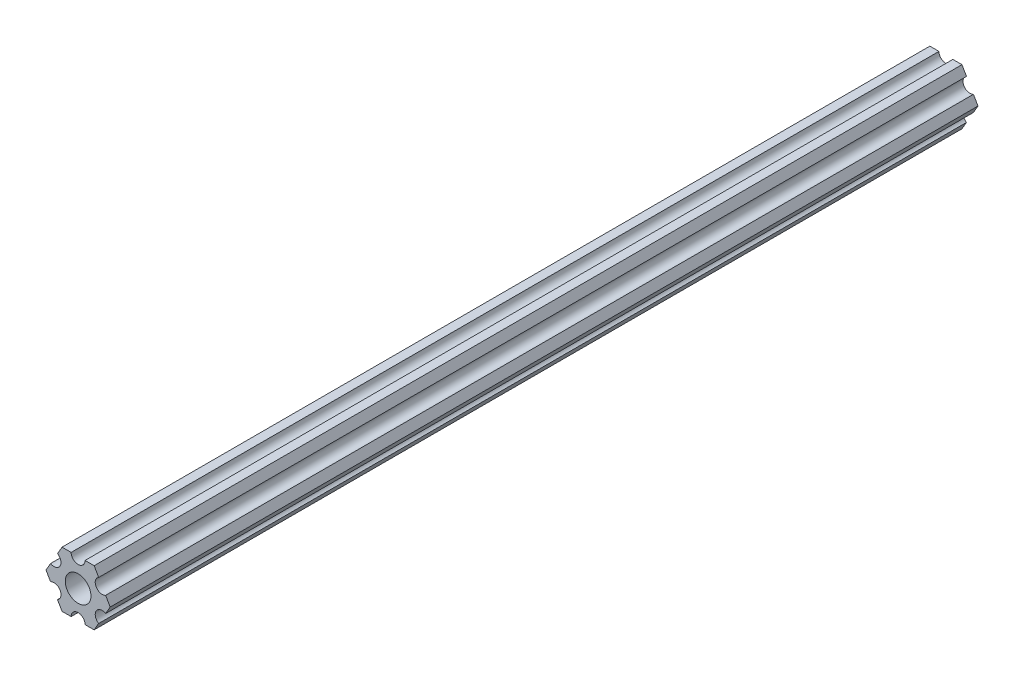
ISO-10303-21;
HEADER;
FILE_DESCRIPTION(('STEP AP214'),'2;1');
FILE_NAME('part.step','',(''),(''),'','','');
FILE_SCHEMA(('AUTOMOTIVE_DESIGN { 1 0 10303 214 1 1 1 1 }'));
ENDSEC;
DATA;
#1=APPLICATION_CONTEXT('core data for automotive mechanical design processes');
#2=APPLICATION_PROTOCOL_DEFINITION('international standard','automotive_design',2000,#1);
#3=PRODUCT_CONTEXT('',#1,'mechanical');
#4=PRODUCT('Part','Part','',(#3));
#5=PRODUCT_RELATED_PRODUCT_CATEGORY('part','',(#4));
#6=PRODUCT_DEFINITION_FORMATION('','',#4);
#7=PRODUCT_DEFINITION_CONTEXT('part definition',#1,'design');
#8=PRODUCT_DEFINITION('design','',#6,#7);
#9=PRODUCT_DEFINITION_SHAPE('','',#8);
#10=(LENGTH_UNIT() NAMED_UNIT(*) SI_UNIT(.MILLI.,.METRE.));
#11=(NAMED_UNIT(*) PLANE_ANGLE_UNIT() SI_UNIT($,.RADIAN.));
#12=(NAMED_UNIT(*) SI_UNIT($,.STERADIAN.) SOLID_ANGLE_UNIT());
#13=UNCERTAINTY_MEASURE_WITH_UNIT(LENGTH_MEASURE(1.E-05),#10,'distance_accuracy_value','');
#14=(GEOMETRIC_REPRESENTATION_CONTEXT(3) GLOBAL_UNCERTAINTY_ASSIGNED_CONTEXT((#13)) GLOBAL_UNIT_ASSIGNED_CONTEXT((#10,
#11,#12)) REPRESENTATION_CONTEXT('',''));
#15=CARTESIAN_POINT('',(0.,0.,0.));
#16=DIRECTION('',(0.,0.,1.));
#17=DIRECTION('',(1.,0.,0.));
#18=AXIS2_PLACEMENT_3D('',#15,#16,#17);
#19=CARTESIAN_POINT('',(6.29301142309098,-1.80018429024546,304.8));
#20=DIRECTION('',(-0.866025434075723,0.499999947533953,0.));
#21=DIRECTION('',(-0.499999947533953,-0.866025434075723,0.));
#22=AXIS2_PLACEMENT_3D('',#19,#20,#21);
#23=PLANE('',#22);
#24=DIRECTION('',(0.499999947533953,0.866025434075723,0.));
#25=VECTOR('',#24,1.);
#26=CARTESIAN_POINT('',(6.29301142309098,-1.80018429024546,-130.524));
#27=LINE('',#26,#25);
#28=CARTESIAN_POINT('',(6.29301142309098,-1.80018429024546,-130.524));
#29=VERTEX_POINT('',#28);
#30=CARTESIAN_POINT('',(7.33234841870826,4.44212518896171E-07,-130.524));
#31=VERTEX_POINT('',#30);
#32=EDGE_CURVE('E140',#29,#31,#27,.T.);
#33=ORIENTED_EDGE('',*,*,#32,.T.);
#34=DIRECTION('',(0.,0.,1.));
#35=VECTOR('',#34,1.);
#36=CARTESIAN_POINT('',(7.33234841870826,4.44212519225153E-07,304.8));
#37=LINE('',#36,#35);
#38=CARTESIAN_POINT('',(7.33234841870826,4.44212519207655E-07,67.726));
#39=VERTEX_POINT('',#38);
#40=EDGE_CURVE('E127',#31,#39,#37,.T.);
#41=ORIENTED_EDGE('',*,*,#40,.T.);
#42=DIRECTION('',(0.499999947533953,0.866025434075723,0.));
#43=VECTOR('',#42,1.);
#44=CARTESIAN_POINT('',(6.29301142309098,-1.80018429024546,67.726));
#45=LINE('',#44,#43);
#46=CARTESIAN_POINT('',(6.29301142309098,-1.80018429024546,67.726));
#47=VERTEX_POINT('',#46);
#48=EDGE_CURVE('E146',#47,#39,#45,.T.);
#49=ORIENTED_EDGE('',*,*,#48,.F.);
#50=DIRECTION('',(0.,0.,-1.));
#51=VECTOR('',#50,1.);
#52=CARTESIAN_POINT('',(6.29301142309098,-1.80018429024546,304.8));
#53=LINE('',#52,#51);
#54=EDGE_CURVE('E145',#47,#29,#53,.T.);
#55=ORIENTED_EDGE('',*,*,#54,.T.);
#56=EDGE_LOOP('',(#33,#41,#49,#55));
#57=FACE_BOUND('',#56,.T.);
#58=ADVANCED_FACE('F16',(#57),#23,.F.);
#59=CARTESIAN_POINT('',(7.33234841870826,4.44212519169686E-07,304.8));
#60=DIRECTION('',(-0.866025373493145,-0.500000052466056,0.));
#61=DIRECTION('',(0.500000052466056,-0.866025373493145,0.));
#62=AXIS2_PLACEMENT_3D('',#59,#60,#61);
#63=PLANE('',#62);
#64=DIRECTION('',(-0.500000052466056,0.866025373493145,0.));
#65=VECTOR('',#64,1.);
#66=CARTESIAN_POINT('',(7.33234841870826,4.44212519198905E-07,-130.524));
#67=LINE('',#66,#65);
#68=CARTESIAN_POINT('',(6.29301120497139,1.80018505273894,-130.524));
#69=VERTEX_POINT('',#68);
#70=EDGE_CURVE('E130',#31,#69,#67,.T.);
#71=ORIENTED_EDGE('',*,*,#70,.T.);
#72=DIRECTION('',(0.,0.,-1.));
#73=VECTOR('',#72,1.);
#74=CARTESIAN_POINT('',(6.29301120497139,1.80018505273894,304.8));
#75=LINE('',#74,#73);
#76=CARTESIAN_POINT('',(6.29301120497139,1.80018505273894,67.726));
#77=VERTEX_POINT('',#76);
#78=EDGE_CURVE('E119',#69,#77,#75,.F.);
#79=ORIENTED_EDGE('',*,*,#78,.T.);
#80=DIRECTION('',(-0.500000052466056,0.866025373493145,0.));
#81=VECTOR('',#80,1.);
#82=CARTESIAN_POINT('',(7.33234841870826,4.44212519198905E-07,67.726));
#83=LINE('',#82,#81);
#84=EDGE_CURVE('E131',#39,#77,#83,.T.);
#85=ORIENTED_EDGE('',*,*,#84,.F.);
#86=ORIENTED_EDGE('',*,*,#40,.F.);
#87=EDGE_LOOP('',(#71,#79,#85,#86));
#88=FACE_BOUND('',#87,.T.);
#89=ADVANCED_FACE('F129',(#88),#63,.F.);
#90=CARTESIAN_POINT('',(5.49926112168156,3.17500033315933,304.8));
#91=DIRECTION('',(0.,0.,-1.));
#92=DIRECTION('',(-1.,0.,0.));
#93=AXIS2_PLACEMENT_3D('',#90,#91,#92);
#94=CYLINDRICAL_SURFACE('',#93,1.5875);
#95=CARTESIAN_POINT('',(5.49926112168156,3.17500033315933,-130.524));
#96=DIRECTION('',(0.,0.,-1.));
#97=DIRECTION('',(-1.,0.,0.));
#98=AXIS2_PLACEMENT_3D('',#95,#96,#97);
#99=CIRCLE('',#98,1.5875);
#100=CARTESIAN_POINT('',(4.70551103839172,4.54981561357972,-130.524));
#101=VERTEX_POINT('',#100);
#102=EDGE_CURVE('E19',#69,#101,#99,.T.);
#103=ORIENTED_EDGE('',*,*,#102,.T.);
#104=DIRECTION('',(0.,0.,1.));
#105=VECTOR('',#104,1.);
#106=CARTESIAN_POINT('',(4.70551103839172,4.54981561357972,304.8));
#107=LINE('',#106,#105);
#108=CARTESIAN_POINT('',(4.70551103839172,4.54981561357972,67.726));
#109=VERTEX_POINT('',#108);
#110=EDGE_CURVE('E262',#101,#109,#107,.T.);
#111=ORIENTED_EDGE('',*,*,#110,.T.);
#112=CARTESIAN_POINT('',(5.49926112168156,3.17500033315933,67.726));
#113=DIRECTION('',(0.,0.,-1.));
#114=DIRECTION('',(-1.,0.,0.));
#115=AXIS2_PLACEMENT_3D('',#112,#113,#114);
#116=CIRCLE('',#115,1.5875);
#117=EDGE_CURVE('E290',#77,#109,#116,.T.);
#118=ORIENTED_EDGE('',*,*,#117,.F.);
#119=ORIENTED_EDGE('',*,*,#78,.F.);
#120=EDGE_LOOP('',(#103,#111,#118,#119));
#121=FACE_BOUND('',#120,.T.);
#122=ADVANCED_FACE('F560',(#121),#94,.F.);
#123=CARTESIAN_POINT('',(4.70551103839172,4.54981561357972,304.8));
#124=DIRECTION('',(-0.866025373493151,-0.500000052466046,0.));
#125=DIRECTION('',(0.500000052466046,-0.866025373493151,0.));
#126=AXIS2_PLACEMENT_3D('',#123,#124,#125);
#127=PLANE('',#126);
#128=DIRECTION('',(-0.500000052466044,0.866025373493152,0.));
#129=VECTOR('',#128,1.);
#130=CARTESIAN_POINT('',(4.70551103839172,4.54981561357972,-130.524));
#131=LINE('',#130,#129);
#132=CARTESIAN_POINT('',(3.66617382465481,6.35000022210627,-130.524));
#133=VERTEX_POINT('',#132);
#134=EDGE_CURVE('E204',#101,#133,#131,.T.);
#135=ORIENTED_EDGE('',*,*,#134,.T.);
#136=DIRECTION('',(0.,0.,1.));
#137=VECTOR('',#136,1.);
#138=CARTESIAN_POINT('',(3.66617382465481,6.35000022210627,304.8));
#139=LINE('',#138,#137);
#140=CARTESIAN_POINT('',(3.66617382465481,6.35000022210627,67.726));
#141=VERTEX_POINT('',#140);
#142=EDGE_CURVE('E259',#133,#141,#139,.T.);
#143=ORIENTED_EDGE('',*,*,#142,.T.);
#144=DIRECTION('',(-0.500000052466044,0.866025373493152,0.));
#145=VECTOR('',#144,1.);
#146=CARTESIAN_POINT('',(4.70551103839172,4.54981561357972,67.726));
#147=LINE('',#146,#145);
#148=EDGE_CURVE('E291',#109,#141,#147,.T.);
#149=ORIENTED_EDGE('',*,*,#148,.F.);
#150=ORIENTED_EDGE('',*,*,#110,.F.);
#151=EDGE_LOOP('',(#135,#143,#149,#150));
#152=FACE_BOUND('',#151,.T.);
#153=ADVANCED_FACE('F314',(#152),#127,.F.);
#154=CARTESIAN_POINT('',(3.66617382465481,6.35000022210627,304.8));
#155=DIRECTION('',(6.05825850611185E-08,-0.999999999999998,0.));
#156=DIRECTION('',(0.999999999999998,6.05825850611185E-08,0.));
#157=AXIS2_PLACEMENT_3D('',#154,#155,#156);
#158=PLANE('',#157);
#159=DIRECTION('',(1.,0.,0.));
#160=VECTOR('',#159,1.);
#161=CARTESIAN_POINT('',(5.49926112168156,6.35000022210627,-130.524));
#162=LINE('',#161,#160);
#163=CARTESIAN_POINT('',(1.58749961530073,6.35000015914054,-130.524));
#164=VERTEX_POINT('',#163);
#165=EDGE_CURVE('E201',#133,#164,#162,.F.);
#166=ORIENTED_EDGE('',*,*,#165,.T.);
#167=DIRECTION('',(0.,0.,-1.));
#168=VECTOR('',#167,1.);
#169=CARTESIAN_POINT('',(1.58749961530074,6.35000009617482,304.8));
#170=LINE('',#169,#168);
#171=CARTESIAN_POINT('',(1.58749961530073,6.35000015914054,67.726));
#172=VERTEX_POINT('',#171);
#173=EDGE_CURVE('E256',#164,#172,#170,.F.);
#174=ORIENTED_EDGE('',*,*,#173,.T.);
#175=DIRECTION('',(1.,0.,0.));
#176=VECTOR('',#175,1.);
#177=CARTESIAN_POINT('',(5.49926112168156,6.35000022210627,67.726));
#178=LINE('',#177,#176);
#179=EDGE_CURVE('E289',#141,#172,#178,.F.);
#180=ORIENTED_EDGE('',*,*,#179,.F.);
#181=ORIENTED_EDGE('',*,*,#142,.F.);
#182=EDGE_LOOP('',(#166,#174,#180,#181));
#183=FACE_BOUND('',#182,.T.);
#184=ADVANCED_FACE('F309',(#183),#158,.F.);
#185=CARTESIAN_POINT('',(-3.84699260060323E-07,6.35,304.8));
#186=DIRECTION('',(0.,0.,-1.));
#187=DIRECTION('',(-1.,0.,0.));
#188=AXIS2_PLACEMENT_3D('',#185,#186,#187);
#189=CYLINDRICAL_SURFACE('',#188,1.5875);
#190=CARTESIAN_POINT('',(-3.84699260060323E-07,6.35,-130.524));
#191=DIRECTION('',(0.,0.,-1.));
#192=DIRECTION('',(-1.,0.,0.));
#193=AXIS2_PLACEMENT_3D('',#190,#191,#192);
#194=CIRCLE('',#193,1.5875);
#195=CARTESIAN_POINT('',(-1.58750038469926,6.34999990382518,-130.524));
#196=VERTEX_POINT('',#195);
#197=EDGE_CURVE('E198',#164,#196,#194,.T.);
#198=ORIENTED_EDGE('',*,*,#197,.T.);
#199=DIRECTION('',(0.,0.,1.));
#200=VECTOR('',#199,1.);
#201=CARTESIAN_POINT('',(-1.58750038469926,6.34999990382518,304.8));
#202=LINE('',#201,#200);
#203=CARTESIAN_POINT('',(-1.58750038469926,6.34999990382518,67.726));
#204=VERTEX_POINT('',#203);
#205=EDGE_CURVE('E251',#196,#204,#202,.T.);
#206=ORIENTED_EDGE('',*,*,#205,.T.);
#207=CARTESIAN_POINT('',(-3.84699260060323E-07,6.35,67.726));
#208=DIRECTION('',(0.,0.,-1.));
#209=DIRECTION('',(-1.,0.,0.));
#210=AXIS2_PLACEMENT_3D('',#207,#208,#209);
#211=CIRCLE('',#210,1.5875);
#212=EDGE_CURVE('E286',#172,#204,#211,.T.);
#213=ORIENTED_EDGE('',*,*,#212,.F.);
#214=ORIENTED_EDGE('',*,*,#173,.F.);
#215=EDGE_LOOP('',(#198,#206,#213,#214));
#216=FACE_BOUND('',#215,.T.);
#217=ADVANCED_FACE('F301',(#216),#189,.F.);
#218=CARTESIAN_POINT('',(-1.58750038469926,6.34999990382518,304.8));
#219=DIRECTION('',(6.05825963273174E-08,-0.999999999999998,0.));
#220=DIRECTION('',(0.999999999999998,6.05825963273174E-08,0.));
#221=AXIS2_PLACEMENT_3D('',#218,#219,#220);
#222=PLANE('',#221);
#223=DIRECTION('',(1.,0.,0.));
#224=VECTOR('',#223,1.);
#225=CARTESIAN_POINT('',(5.49926112168156,6.34999990382519,-130.524));
#226=LINE('',#225,#224);
#227=CARTESIAN_POINT('',(-3.66617454558244,6.34999986184803,-130.524));
#228=VERTEX_POINT('',#227);
#229=EDGE_CURVE('E193',#196,#228,#226,.F.);
#230=ORIENTED_EDGE('',*,*,#229,.T.);
#231=DIRECTION('',(0.,0.,1.));
#232=VECTOR('',#231,1.);
#233=CARTESIAN_POINT('',(-3.66617459405349,6.3499997778937,304.8));
#234=LINE('',#233,#232);
#235=CARTESIAN_POINT('',(-3.66617454558244,6.34999986184803,67.726));
#236=VERTEX_POINT('',#235);
#237=EDGE_CURVE('E248',#228,#236,#234,.T.);
#238=ORIENTED_EDGE('',*,*,#237,.T.);
#239=DIRECTION('',(1.,0.,0.));
#240=VECTOR('',#239,1.);
#241=CARTESIAN_POINT('',(5.49926112168156,6.34999990382519,67.726));
#242=LINE('',#241,#240);
#243=EDGE_CURVE('E288',#204,#236,#242,.F.);
#244=ORIENTED_EDGE('',*,*,#243,.F.);
#245=ORIENTED_EDGE('',*,*,#205,.F.);
#246=EDGE_LOOP('',(#230,#238,#244,#245));
#247=FACE_BOUND('',#246,.T.);
#248=ADVANCED_FACE('F369',(#247),#222,.F.);
#249=CARTESIAN_POINT('',(-3.66617459405349,6.3499997778937,304.8));
#250=DIRECTION('',(0.866025434075729,-0.499999947533943,0.));
#251=DIRECTION('',(0.499999947533943,0.866025434075729,0.));
#252=AXIS2_PLACEMENT_3D('',#249,#250,#251);
#253=PLANE('',#252);
#254=DIRECTION('',(-0.499999947533941,-0.86602543407573,0.));
#255=VECTOR('',#254,1.);
#256=CARTESIAN_POINT('',(-3.66617459405349,6.3499997778937,-130.524));
#257=LINE('',#256,#255);
#258=CARTESIAN_POINT('',(-4.70551158967065,4.54981504343587,-130.524));
#259=VERTEX_POINT('',#258);
#260=EDGE_CURVE('E190',#228,#259,#257,.T.);
#261=ORIENTED_EDGE('',*,*,#260,.T.);
#262=DIRECTION('',(0.,0.,-1.));
#263=VECTOR('',#262,1.);
#264=CARTESIAN_POINT('',(-4.70551158967065,4.54981504343587,304.8));
#265=LINE('',#264,#263);
#266=CARTESIAN_POINT('',(-4.70551158967065,4.54981504343587,67.726));
#267=VERTEX_POINT('',#266);
#268=EDGE_CURVE('E245',#259,#267,#265,.F.);
#269=ORIENTED_EDGE('',*,*,#268,.T.);
#270=DIRECTION('',(-0.499999947533941,-0.86602543407573,0.));
#271=VECTOR('',#270,1.);
#272=CARTESIAN_POINT('',(-3.66617459405349,6.3499997778937,67.726));
#273=LINE('',#272,#271);
#274=EDGE_CURVE('E285',#236,#267,#273,.T.);
#275=ORIENTED_EDGE('',*,*,#274,.F.);
#276=ORIENTED_EDGE('',*,*,#237,.F.);
#277=EDGE_LOOP('',(#261,#269,#275,#276));
#278=FACE_BOUND('',#277,.T.);
#279=ADVANCED_FACE('F371',(#278),#253,.F.);
#280=CARTESIAN_POINT('',(-5.49926150638082,3.17499966684067,304.8));
#281=DIRECTION('',(0.,0.,-1.));
#282=DIRECTION('',(-1.,0.,0.));
#283=AXIS2_PLACEMENT_3D('',#280,#281,#282);
#284=CYLINDRICAL_SURFACE('',#283,1.5875);
#285=CARTESIAN_POINT('',(-5.49926150638082,3.17499966684067,-130.524));
#286=DIRECTION('',(0.,0.,-1.));
#287=DIRECTION('',(-1.,0.,0.));
#288=AXIS2_PLACEMENT_3D('',#285,#286,#287);
#289=CIRCLE('',#288,1.5875);
#290=CARTESIAN_POINT('',(-6.29301142309098,1.80018429024547,-130.524));
#291=VERTEX_POINT('',#290);
#292=EDGE_CURVE('E187',#259,#291,#289,.T.);
#293=ORIENTED_EDGE('',*,*,#292,.T.);
#294=DIRECTION('',(0.,0.,1.));
#295=VECTOR('',#294,1.);
#296=CARTESIAN_POINT('',(-6.29301142309098,1.80018429024547,304.8));
#297=LINE('',#296,#295);
#298=CARTESIAN_POINT('',(-6.29301142309098,1.80018429024547,67.726));
#299=VERTEX_POINT('',#298);
#300=EDGE_CURVE('E240',#291,#299,#297,.T.);
#301=ORIENTED_EDGE('',*,*,#300,.T.);
#302=CARTESIAN_POINT('',(-5.49926150638082,3.17499966684067,67.726));
#303=DIRECTION('',(0.,0.,-1.));
#304=DIRECTION('',(-1.,0.,0.));
#305=AXIS2_PLACEMENT_3D('',#302,#303,#304);
#306=CIRCLE('',#305,1.5875);
#307=EDGE_CURVE('E282',#267,#299,#306,.T.);
#308=ORIENTED_EDGE('',*,*,#307,.F.);
#309=ORIENTED_EDGE('',*,*,#268,.F.);
#310=EDGE_LOOP('',(#293,#301,#308,#309));
#311=FACE_BOUND('',#310,.T.);
#312=ADVANCED_FACE('F407',(#311),#284,.F.);
#313=CARTESIAN_POINT('',(-6.29301142309098,1.80018429024547,304.8));
#314=DIRECTION('',(0.866025434075724,-0.499999947533951,0.));
#315=DIRECTION('',(0.499999947533951,0.866025434075724,0.));
#316=AXIS2_PLACEMENT_3D('',#313,#314,#315);
#317=PLANE('',#316);
#318=DIRECTION('',(-0.49999994753395,-0.866025434075724,0.));
#319=VECTOR('',#318,1.);
#320=CARTESIAN_POINT('',(-6.29301142309098,1.80018429024547,-130.524));
#321=LINE('',#320,#319);
#322=CARTESIAN_POINT('',(-7.33234841870826,-4.44212523605446E-07,-130.524));
#323=VERTEX_POINT('',#322);
#324=EDGE_CURVE('E182',#291,#323,#321,.T.);
#325=ORIENTED_EDGE('',*,*,#324,.T.);
#326=DIRECTION('',(0.,0.,1.));
#327=VECTOR('',#326,1.);
#328=CARTESIAN_POINT('',(-7.33234841870826,-4.44212523744911E-07,304.8));
#329=LINE('',#328,#327);
#330=CARTESIAN_POINT('',(-7.33234841870826,-4.44212523605446E-07,67.726));
#331=VERTEX_POINT('',#330);
#332=EDGE_CURVE('E237',#323,#331,#329,.T.);
#333=ORIENTED_EDGE('',*,*,#332,.T.);
#334=DIRECTION('',(-0.49999994753395,-0.866025434075724,0.));
#335=VECTOR('',#334,1.);
#336=CARTESIAN_POINT('',(-6.29301142309098,1.80018429024547,67.726));
#337=LINE('',#336,#335);
#338=EDGE_CURVE('E284',#299,#331,#337,.T.);
#339=ORIENTED_EDGE('',*,*,#338,.F.);
#340=ORIENTED_EDGE('',*,*,#300,.F.);
#341=EDGE_LOOP('',(#325,#333,#339,#340));
#342=FACE_BOUND('',#341,.T.);
#343=ADVANCED_FACE('F360',(#342),#317,.F.);
#344=CARTESIAN_POINT('',(-7.33234841870826,-4.44212523790841E-07,304.8));
#345=DIRECTION('',(0.866025373493151,0.500000052466045,0.));
#346=DIRECTION('',(-0.500000052466045,0.866025373493151,0.));
#347=AXIS2_PLACEMENT_3D('',#344,#345,#346);
#348=PLANE('',#347);
#349=DIRECTION('',(0.500000052466043,-0.866025373493152,0.));
#350=VECTOR('',#349,1.);
#351=CARTESIAN_POINT('',(-7.33234841870826,-4.44212523535714E-07,-130.524));
#352=LINE('',#351,#350);
#353=CARTESIAN_POINT('',(-6.29301120497141,-1.80018505273897,-130.524));
#354=VERTEX_POINT('',#353);
#355=EDGE_CURVE('E179',#323,#354,#352,.T.);
#356=ORIENTED_EDGE('',*,*,#355,.T.);
#357=DIRECTION('',(0.,0.,-1.));
#358=VECTOR('',#357,1.);
#359=CARTESIAN_POINT('',(-6.29301120497141,-1.80018505273897,304.8));
#360=LINE('',#359,#358);
#361=CARTESIAN_POINT('',(-6.29301120497141,-1.80018505273897,67.726));
#362=VERTEX_POINT('',#361);
#363=EDGE_CURVE('E234',#354,#362,#360,.F.);
#364=ORIENTED_EDGE('',*,*,#363,.T.);
#365=DIRECTION('',(0.500000052466043,-0.866025373493152,0.));
#366=VECTOR('',#365,1.);
#367=CARTESIAN_POINT('',(-7.33234841870826,-4.44212523535714E-07,67.726));
#368=LINE('',#367,#366);
#369=EDGE_CURVE('E281',#331,#362,#368,.T.);
#370=ORIENTED_EDGE('',*,*,#369,.F.);
#371=ORIENTED_EDGE('',*,*,#332,.F.);
#372=EDGE_LOOP('',(#356,#364,#370,#371));
#373=FACE_BOUND('',#372,.T.);
#374=ADVANCED_FACE('F355',(#373),#348,.F.);
#375=CARTESIAN_POINT('',(-5.49926112168156,-3.17500033315934,304.8));
#376=DIRECTION('',(0.,0.,-1.));
#377=DIRECTION('',(-1.,0.,0.));
#378=AXIS2_PLACEMENT_3D('',#375,#376,#377);
#379=CYLINDRICAL_SURFACE('',#378,1.5875);
#380=CARTESIAN_POINT('',(-5.49926112168156,-3.17500033315934,-130.524));
#381=DIRECTION('',(0.,0.,-1.));
#382=DIRECTION('',(-1.,0.,0.));
#383=AXIS2_PLACEMENT_3D('',#380,#381,#382);
#384=CIRCLE('',#383,1.5875);
#385=CARTESIAN_POINT('',(-4.70551103839172,-4.54981561357972,-130.524));
#386=VERTEX_POINT('',#385);
#387=EDGE_CURVE('E176',#354,#386,#384,.T.);
#388=ORIENTED_EDGE('',*,*,#387,.T.);
#389=DIRECTION('',(0.,0.,1.));
#390=VECTOR('',#389,1.);
#391=CARTESIAN_POINT('',(-4.70551103839172,-4.54981561357972,304.8));
#392=LINE('',#391,#390);
#393=CARTESIAN_POINT('',(-4.70551103839172,-4.54981561357972,67.726));
#394=VERTEX_POINT('',#393);
#395=EDGE_CURVE('E229',#386,#394,#392,.T.);
#396=ORIENTED_EDGE('',*,*,#395,.T.);
#397=CARTESIAN_POINT('',(-5.49926112168156,-3.17500033315934,67.726));
#398=DIRECTION('',(0.,0.,-1.));
#399=DIRECTION('',(-1.,0.,0.));
#400=AXIS2_PLACEMENT_3D('',#397,#398,#399);
#401=CIRCLE('',#400,1.5875);
#402=EDGE_CURVE('E278',#362,#394,#401,.T.);
#403=ORIENTED_EDGE('',*,*,#402,.F.);
#404=ORIENTED_EDGE('',*,*,#363,.F.);
#405=EDGE_LOOP('',(#388,#396,#403,#404));
#406=FACE_BOUND('',#405,.T.);
#407=ADVANCED_FACE('F350',(#406),#379,.F.);
#408=CARTESIAN_POINT('',(-4.70551103839172,-4.54981561357972,304.8));
#409=DIRECTION('',(0.866025373493151,0.500000052466045,0.));
#410=DIRECTION('',(-0.500000052466045,0.866025373493151,0.));
#411=AXIS2_PLACEMENT_3D('',#408,#409,#410);
#412=PLANE('',#411);
#413=DIRECTION('',(0.500000052466043,-0.866025373493152,0.));
#414=VECTOR('',#413,1.);
#415=CARTESIAN_POINT('',(-4.70551103839172,-4.54981561357972,-130.524));
#416=LINE('',#415,#414);
#417=CARTESIAN_POINT('',(-3.66617382465481,-6.35000022210627,-130.524));
#418=VERTEX_POINT('',#417);
#419=EDGE_CURVE('E171',#386,#418,#416,.T.);
#420=ORIENTED_EDGE('',*,*,#419,.T.);
#421=DIRECTION('',(0.,0.,1.));
#422=VECTOR('',#421,1.);
#423=CARTESIAN_POINT('',(-3.66617382465481,-6.35000022210627,304.8));
#424=LINE('',#423,#422);
#425=CARTESIAN_POINT('',(-3.66617382465481,-6.35000022210627,67.726));
#426=VERTEX_POINT('',#425);
#427=EDGE_CURVE('E226',#418,#426,#424,.T.);
#428=ORIENTED_EDGE('',*,*,#427,.T.);
#429=DIRECTION('',(0.500000052466043,-0.866025373493152,0.));
#430=VECTOR('',#429,1.);
#431=CARTESIAN_POINT('',(-4.70551103839172,-4.54981561357972,67.726));
#432=LINE('',#431,#430);
#433=EDGE_CURVE('E280',#394,#426,#432,.T.);
#434=ORIENTED_EDGE('',*,*,#433,.F.);
#435=ORIENTED_EDGE('',*,*,#395,.F.);
#436=EDGE_LOOP('',(#420,#428,#434,#435));
#437=FACE_BOUND('',#436,.T.);
#438=ADVANCED_FACE('F345',(#437),#412,.F.);
#439=CARTESIAN_POINT('',(-3.66617382465481,-6.35000022210627,304.8));
#440=DIRECTION('',(-6.05825854783851E-08,0.999999999999998,0.));
#441=DIRECTION('',(-0.999999999999998,-6.05825854783851E-08,0.));
#442=AXIS2_PLACEMENT_3D('',#439,#440,#441);
#443=PLANE('',#442);
#444=DIRECTION('',(1.,0.,0.));
#445=VECTOR('',#444,1.);
#446=CARTESIAN_POINT('',(5.49926112168156,-6.35000022210627,-130.524));
#447=LINE('',#446,#445);
#448=CARTESIAN_POINT('',(-1.58749961530073,-6.35000011105313,-130.524));
#449=VERTEX_POINT('',#448);
#450=EDGE_CURVE('E168',#418,#449,#447,.T.);
#451=ORIENTED_EDGE('',*,*,#450,.T.);
#452=DIRECTION('',(0.,0.,-1.));
#453=VECTOR('',#452,1.);
#454=CARTESIAN_POINT('',(-1.58749961530074,-6.35,304.8));
#455=LINE('',#454,#453);
#456=CARTESIAN_POINT('',(-1.58749961530073,-6.35000011105313,67.726));
#457=VERTEX_POINT('',#456);
#458=EDGE_CURVE('E223',#449,#457,#455,.F.);
#459=ORIENTED_EDGE('',*,*,#458,.T.);
#460=DIRECTION('',(1.,0.,0.));
#461=VECTOR('',#460,1.);
#462=CARTESIAN_POINT('',(5.49926112168156,-6.35000022210627,67.726));
#463=LINE('',#462,#461);
#464=EDGE_CURVE('E277',#426,#457,#463,.T.);
#465=ORIENTED_EDGE('',*,*,#464,.F.);
#466=ORIENTED_EDGE('',*,*,#427,.F.);
#467=EDGE_LOOP('',(#451,#459,#465,#466));
#468=FACE_BOUND('',#467,.T.);
#469=ADVANCED_FACE('F339',(#468),#443,.F.);
#470=CARTESIAN_POINT('',(3.8469926204343E-07,-6.35,304.8));
#471=DIRECTION('',(0.,0.,-1.));
#472=DIRECTION('',(-1.,0.,0.));
#473=AXIS2_PLACEMENT_3D('',#470,#471,#472);
#474=CYLINDRICAL_SURFACE('',#473,1.5875);
#475=CARTESIAN_POINT('',(3.8469926204343E-07,-6.35,-130.524));
#476=DIRECTION('',(0.,0.,-1.));
#477=DIRECTION('',(-1.,0.,0.));
#478=AXIS2_PLACEMENT_3D('',#475,#476,#477);
#479=CIRCLE('',#478,1.5875);
#480=CARTESIAN_POINT('',(1.58750038469926,-6.34999990382518,-130.524));
#481=VERTEX_POINT('',#480);
#482=EDGE_CURVE('E165',#449,#481,#479,.T.);
#483=ORIENTED_EDGE('',*,*,#482,.T.);
#484=DIRECTION('',(0.,0.,1.));
#485=VECTOR('',#484,1.);
#486=CARTESIAN_POINT('',(1.58750038469926,-6.34999990382518,304.8));
#487=LINE('',#486,#485);
#488=CARTESIAN_POINT('',(1.58750038469926,-6.34999990382518,67.726));
#489=VERTEX_POINT('',#488);
#490=EDGE_CURVE('E218',#481,#489,#487,.T.);
#491=ORIENTED_EDGE('',*,*,#490,.T.);
#492=CARTESIAN_POINT('',(3.8469926204343E-07,-6.35,67.726));
#493=DIRECTION('',(0.,0.,-1.));
#494=DIRECTION('',(-1.,0.,0.));
#495=AXIS2_PLACEMENT_3D('',#492,#493,#494);
#496=CIRCLE('',#495,1.5875);
#497=EDGE_CURVE('E274',#457,#489,#496,.T.);
#498=ORIENTED_EDGE('',*,*,#497,.F.);
#499=ORIENTED_EDGE('',*,*,#458,.F.);
#500=EDGE_LOOP('',(#483,#491,#498,#499));
#501=FACE_BOUND('',#500,.T.);
#502=ADVANCED_FACE('F335',(#501),#474,.F.);
#503=CARTESIAN_POINT('',(1.58750038469926,-6.34999990382518,304.8));
#504=DIRECTION('',(-6.05825721258438E-08,0.999999999999998,0.));
#505=DIRECTION('',(-0.999999999999998,-6.05825721258438E-08,0.));
#506=AXIS2_PLACEMENT_3D('',#503,#504,#505);
#507=PLANE('',#506);
#508=DIRECTION('',(1.,0.,0.));
#509=VECTOR('',#508,1.);
#510=CARTESIAN_POINT('',(5.49926112168156,-6.34999990382518,-130.524));
#511=LINE('',#510,#509);
#512=CARTESIAN_POINT('',(3.66617454558244,-6.34999986184804,-130.524));
#513=VERTEX_POINT('',#512);
#514=EDGE_CURVE('E160',#481,#513,#511,.T.);
#515=ORIENTED_EDGE('',*,*,#514,.T.);
#516=DIRECTION('',(0.,0.,1.));
#517=VECTOR('',#516,1.);
#518=CARTESIAN_POINT('',(3.66617459405346,-6.34999977789375,304.8));
#519=LINE('',#518,#517);
#520=CARTESIAN_POINT('',(3.66617454558244,-6.34999986184804,67.726));
#521=VERTEX_POINT('',#520);
#522=EDGE_CURVE('E215',#513,#521,#519,.T.);
#523=ORIENTED_EDGE('',*,*,#522,.T.);
#524=DIRECTION('',(1.,0.,0.));
#525=VECTOR('',#524,1.);
#526=CARTESIAN_POINT('',(5.49926112168156,-6.34999990382518,67.726));
#527=LINE('',#526,#525);
#528=EDGE_CURVE('E276',#489,#521,#527,.T.);
#529=ORIENTED_EDGE('',*,*,#528,.F.);
#530=ORIENTED_EDGE('',*,*,#490,.F.);
#531=EDGE_LOOP('',(#515,#523,#529,#530));
#532=FACE_BOUND('',#531,.T.);
#533=ADVANCED_FACE('F331',(#532),#507,.F.);
#534=CARTESIAN_POINT('',(3.66617459405346,-6.34999977789375,304.8));
#535=DIRECTION('',(-0.86602543407573,0.499999947533941,0.));
#536=DIRECTION('',(-0.499999947533941,-0.86602543407573,0.));
#537=AXIS2_PLACEMENT_3D('',#534,#535,#536);
#538=PLANE('',#537);
#539=DIRECTION('',(0.499999947533941,0.86602543407573,0.));
#540=VECTOR('',#539,1.);
#541=CARTESIAN_POINT('',(3.66617459405346,-6.34999977789375,-130.524));
#542=LINE('',#541,#540);
#543=CARTESIAN_POINT('',(4.70551158967065,-4.54981504343588,-130.524));
#544=VERTEX_POINT('',#543);
#545=EDGE_CURVE('E151',#513,#544,#542,.T.);
#546=ORIENTED_EDGE('',*,*,#545,.T.);
#547=DIRECTION('',(0.,0.,-1.));
#548=VECTOR('',#547,1.);
#549=CARTESIAN_POINT('',(4.70551158967065,-4.54981504343588,304.8));
#550=LINE('',#549,#548);
#551=CARTESIAN_POINT('',(4.70551158967065,-4.54981504343588,67.726));
#552=VERTEX_POINT('',#551);
#553=EDGE_CURVE('E143',#544,#552,#550,.F.);
#554=ORIENTED_EDGE('',*,*,#553,.T.);
#555=DIRECTION('',(0.499999947533941,0.86602543407573,0.));
#556=VECTOR('',#555,1.);
#557=CARTESIAN_POINT('',(3.66617459405346,-6.34999977789375,67.726));
#558=LINE('',#557,#556);
#559=EDGE_CURVE('E34',#521,#552,#558,.T.);
#560=ORIENTED_EDGE('',*,*,#559,.F.);
#561=ORIENTED_EDGE('',*,*,#522,.F.);
#562=EDGE_LOOP('',(#546,#554,#560,#561));
#563=FACE_BOUND('',#562,.T.);
#564=ADVANCED_FACE('F327',(#563),#538,.F.);
#565=CARTESIAN_POINT('',(5.49926150638082,-3.17499966684067,304.8));
#566=DIRECTION('',(0.,0.,-1.));
#567=DIRECTION('',(-1.,0.,0.));
#568=AXIS2_PLACEMENT_3D('',#565,#566,#567);
#569=CYLINDRICAL_SURFACE('',#568,1.58750000000001);
#570=CARTESIAN_POINT('',(5.49926150638082,-3.17499966684067,-130.524));
#571=DIRECTION('',(0.,0.,-1.));
#572=DIRECTION('',(-1.,0.,0.));
#573=AXIS2_PLACEMENT_3D('',#570,#571,#572);
#574=CIRCLE('',#573,1.58750000000001);
#575=EDGE_CURVE('E147',#544,#29,#574,.T.);
#576=ORIENTED_EDGE('',*,*,#575,.T.);
#577=ORIENTED_EDGE('',*,*,#54,.F.);
#578=CARTESIAN_POINT('',(5.49926150638082,-3.17499966684067,67.726));
#579=DIRECTION('',(0.,0.,-1.));
#580=DIRECTION('',(-1.,0.,0.));
#581=AXIS2_PLACEMENT_3D('',#578,#579,#580);
#582=CIRCLE('',#581,1.58750000000001);
#583=EDGE_CURVE('E272',#552,#47,#582,.T.);
#584=ORIENTED_EDGE('',*,*,#583,.F.);
#585=ORIENTED_EDGE('',*,*,#553,.F.);
#586=EDGE_LOOP('',(#576,#577,#584,#585));
#587=FACE_BOUND('',#586,.T.);
#588=ADVANCED_FACE('F322',(#587),#569,.F.);
#589=CARTESIAN_POINT('',(5.49926112168156,3.17500033315933,-130.524));
#590=DIRECTION('',(0.,0.,1.));
#591=DIRECTION('',(1.,0.,0.));
#592=AXIS2_PLACEMENT_3D('',#589,#590,#591);
#593=PLANE('',#592);
#594=CARTESIAN_POINT('',(0.,0.,-130.524));
#595=DIRECTION('',(0.,0.,-1.));
#596=DIRECTION('',(-1.,0.,0.));
#597=AXIS2_PLACEMENT_3D('',#594,#595,#596);
#598=CIRCLE('',#597,2.9337);
#599=CARTESIAN_POINT('',(-2.9337,0.,-130.524));
#600=VERTEX_POINT('',#599);
#601=EDGE_CURVE('E25',#600,#600,#598,.F.);
#602=ORIENTED_EDGE('',*,*,#601,.T.);
#603=EDGE_LOOP('',(#602));
#604=FACE_BOUND('',#603,.T.);
#605=ORIENTED_EDGE('',*,*,#575,.F.);
#606=ORIENTED_EDGE('',*,*,#545,.F.);
#607=ORIENTED_EDGE('',*,*,#514,.F.);
#608=ORIENTED_EDGE('',*,*,#482,.F.);
#609=ORIENTED_EDGE('',*,*,#450,.F.);
#610=ORIENTED_EDGE('',*,*,#419,.F.);
#611=ORIENTED_EDGE('',*,*,#387,.F.);
#612=ORIENTED_EDGE('',*,*,#355,.F.);
#613=ORIENTED_EDGE('',*,*,#324,.F.);
#614=ORIENTED_EDGE('',*,*,#292,.F.);
#615=ORIENTED_EDGE('',*,*,#260,.F.);
#616=ORIENTED_EDGE('',*,*,#229,.F.);
#617=ORIENTED_EDGE('',*,*,#197,.F.);
#618=ORIENTED_EDGE('',*,*,#165,.F.);
#619=ORIENTED_EDGE('',*,*,#134,.F.);
#620=ORIENTED_EDGE('',*,*,#102,.F.);
#621=ORIENTED_EDGE('',*,*,#70,.F.);
#622=ORIENTED_EDGE('',*,*,#32,.F.);
#623=EDGE_LOOP('',(#605,#606,#607,#608,#609,#610,#611,#612,#613,#614,#615,#616,#617,#618,#619,
#620,#621,#622));
#624=FACE_BOUND('',#623,.T.);
#625=ADVANCED_FACE('F139',(#604,#624),#593,.F.);
#626=CARTESIAN_POINT('',(5.49926112168156,3.17500033315933,67.726));
#627=DIRECTION('',(0.,0.,1.));
#628=DIRECTION('',(1.,0.,0.));
#629=AXIS2_PLACEMENT_3D('',#626,#627,#628);
#630=PLANE('',#629);
#631=CARTESIAN_POINT('',(0.,0.,67.726));
#632=DIRECTION('',(0.,0.,-1.));
#633=DIRECTION('',(-1.,0.,0.));
#634=AXIS2_PLACEMENT_3D('',#631,#632,#633);
#635=CIRCLE('',#634,2.9337);
#636=CARTESIAN_POINT('',(-2.9337,0.,67.726));
#637=VERTEX_POINT('',#636);
#638=EDGE_CURVE('E11',#637,#637,#635,.T.);
#639=ORIENTED_EDGE('',*,*,#638,.T.);
#640=EDGE_LOOP('',(#639));
#641=FACE_BOUND('',#640,.T.);
#642=ORIENTED_EDGE('',*,*,#559,.T.);
#643=ORIENTED_EDGE('',*,*,#583,.T.);
#644=ORIENTED_EDGE('',*,*,#48,.T.);
#645=ORIENTED_EDGE('',*,*,#84,.T.);
#646=ORIENTED_EDGE('',*,*,#117,.T.);
#647=ORIENTED_EDGE('',*,*,#148,.T.);
#648=ORIENTED_EDGE('',*,*,#179,.T.);
#649=ORIENTED_EDGE('',*,*,#212,.T.);
#650=ORIENTED_EDGE('',*,*,#243,.T.);
#651=ORIENTED_EDGE('',*,*,#274,.T.);
#652=ORIENTED_EDGE('',*,*,#307,.T.);
#653=ORIENTED_EDGE('',*,*,#338,.T.);
#654=ORIENTED_EDGE('',*,*,#369,.T.);
#655=ORIENTED_EDGE('',*,*,#402,.T.);
#656=ORIENTED_EDGE('',*,*,#433,.T.);
#657=ORIENTED_EDGE('',*,*,#464,.T.);
#658=ORIENTED_EDGE('',*,*,#497,.T.);
#659=ORIENTED_EDGE('',*,*,#528,.T.);
#660=EDGE_LOOP('',(#642,#643,#644,#645,#646,#647,#648,#649,#650,#651,#652,#653,#654,#655,#656,
#657,#658,#659));
#661=FACE_BOUND('',#660,.T.);
#662=ADVANCED_FACE('F319',(#641,#661),#630,.T.);
#663=CARTESIAN_POINT('',(0.,0.,304.8));
#664=DIRECTION('',(0.,0.,-1.));
#665=DIRECTION('',(-1.,0.,0.));
#666=AXIS2_PLACEMENT_3D('',#663,#664,#665);
#667=CYLINDRICAL_SURFACE('',#666,2.9337);
#668=ORIENTED_EDGE('',*,*,#601,.F.);
#669=EDGE_LOOP('',(#668));
#670=FACE_BOUND('',#669,.T.);
#671=ORIENTED_EDGE('',*,*,#638,.F.);
#672=EDGE_LOOP('',(#671));
#673=FACE_BOUND('',#672,.T.);
#674=ADVANCED_FACE('F417',(#670,#673),#667,.F.);
#675=CLOSED_SHELL('',(#58,#89,#122,#153,#184,#217,#248,#279,#312,#343,#374,#407,#438,#469,#502,
#533,#564,#588,#625,#662,#674));
#676=MANIFOLD_SOLID_BREP('B1',#675);
#677=ADVANCED_BREP_SHAPE_REPRESENTATION('',(#18,#676),#14);
#678=SHAPE_DEFINITION_REPRESENTATION(#9,#677);
ENDSEC;
END-ISO-10303-21;
